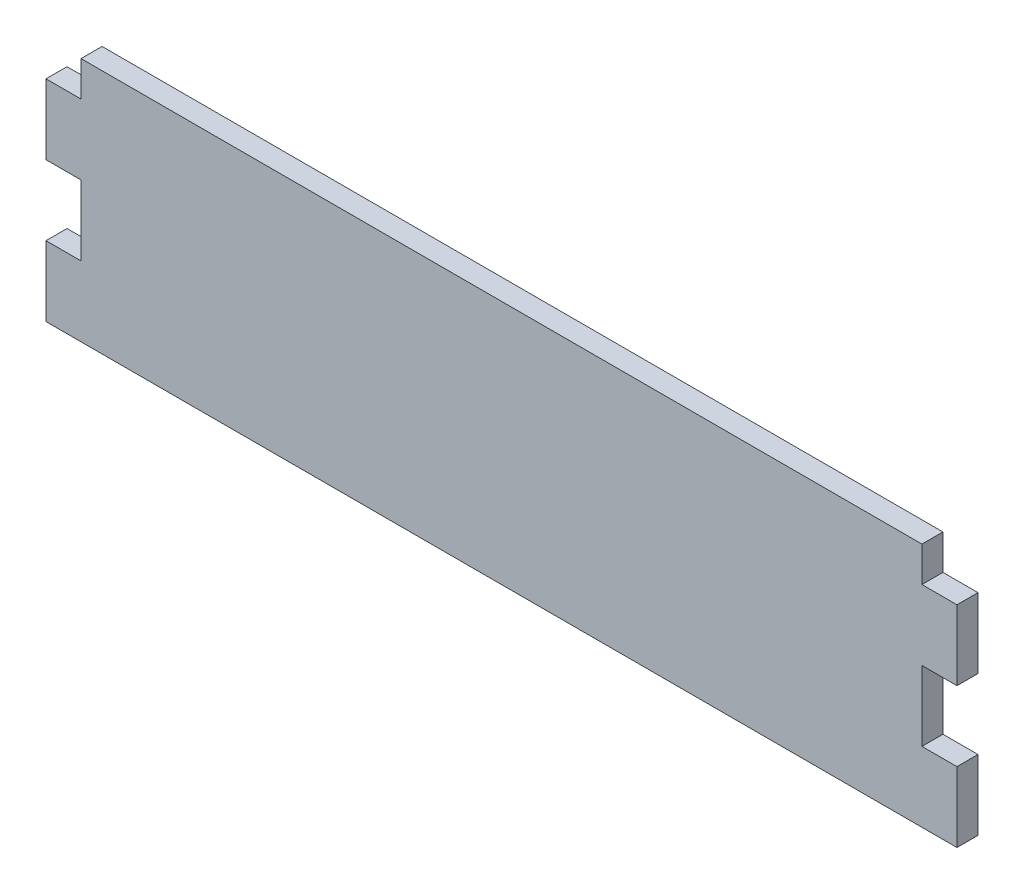
ISO-10303-21;
HEADER;
FILE_DESCRIPTION(('STEP AP214'),'2;1');
FILE_NAME('part.step','',(''),(''),'','','');
FILE_SCHEMA(('AUTOMOTIVE_DESIGN { 1 0 10303 214 1 1 1 1 }'));
ENDSEC;
DATA;
#1=APPLICATION_CONTEXT('core data for automotive mechanical design processes');
#2=APPLICATION_PROTOCOL_DEFINITION('international standard','automotive_design',2000,#1);
#3=PRODUCT_CONTEXT('',#1,'mechanical');
#4=PRODUCT('Part','Part','',(#3));
#5=PRODUCT_RELATED_PRODUCT_CATEGORY('part','',(#4));
#6=PRODUCT_DEFINITION_FORMATION('','',#4);
#7=PRODUCT_DEFINITION_CONTEXT('part definition',#1,'design');
#8=PRODUCT_DEFINITION('design','',#6,#7);
#9=PRODUCT_DEFINITION_SHAPE('','',#8);
#10=(LENGTH_UNIT() NAMED_UNIT(*) SI_UNIT(.MILLI.,.METRE.));
#11=(NAMED_UNIT(*) PLANE_ANGLE_UNIT() SI_UNIT($,.RADIAN.));
#12=(NAMED_UNIT(*) SI_UNIT($,.STERADIAN.) SOLID_ANGLE_UNIT());
#13=UNCERTAINTY_MEASURE_WITH_UNIT(LENGTH_MEASURE(1.E-05),#10,'distance_accuracy_value','');
#14=(GEOMETRIC_REPRESENTATION_CONTEXT(3) GLOBAL_UNCERTAINTY_ASSIGNED_CONTEXT((#13)) GLOBAL_UNIT_ASSIGNED_CONTEXT((#10,
#11,#12)) REPRESENTATION_CONTEXT('',''));
#15=CARTESIAN_POINT('',(0.,0.,0.));
#16=DIRECTION('',(0.,0.,1.));
#17=DIRECTION('',(1.,0.,0.));
#18=AXIS2_PLACEMENT_3D('',#15,#16,#17);
#19=CARTESIAN_POINT('',(119.98,0.,3.));
#20=DIRECTION('',(-1.,0.,0.));
#21=DIRECTION('',(0.,0.,1.));
#22=AXIS2_PLACEMENT_3D('',#19,#20,#21);
#23=PLANE('',#22);
#24=DIRECTION('',(0.,0.,-1.));
#25=VECTOR('',#24,1.);
#26=CARTESIAN_POINT('',(119.98,-15.,3.));
#27=LINE('',#26,#25);
#28=CARTESIAN_POINT('',(119.98,-15.,3.));
#29=VERTEX_POINT('',#28);
#30=CARTESIAN_POINT('',(119.98,-15.,0.));
#31=VERTEX_POINT('',#30);
#32=EDGE_CURVE('E56',#29,#31,#27,.T.);
#33=ORIENTED_EDGE('',*,*,#32,.F.);
#34=DIRECTION('',(0.,1.,0.));
#35=VECTOR('',#34,1.);
#36=CARTESIAN_POINT('',(119.98,0.,3.));
#37=LINE('',#36,#35);
#38=CARTESIAN_POINT('',(119.98,-25.,3.));
#39=VERTEX_POINT('',#38);
#40=EDGE_CURVE('E171',#39,#29,#37,.T.);
#41=ORIENTED_EDGE('',*,*,#40,.F.);
#42=DIRECTION('',(0.,0.,1.));
#43=VECTOR('',#42,1.);
#44=CARTESIAN_POINT('',(119.98,-25.,3.));
#45=LINE('',#44,#43);
#46=CARTESIAN_POINT('',(119.98,-25.,0.));
#47=VERTEX_POINT('',#46);
#48=EDGE_CURVE('E172',#47,#39,#45,.T.);
#49=ORIENTED_EDGE('',*,*,#48,.F.);
#50=DIRECTION('',(0.,1.,0.));
#51=VECTOR('',#50,1.);
#52=CARTESIAN_POINT('',(119.98,0.,0.));
#53=LINE('',#52,#51);
#54=EDGE_CURVE('E255',#47,#31,#53,.T.);
#55=ORIENTED_EDGE('',*,*,#54,.T.);
#56=EDGE_LOOP('',(#33,#41,#49,#55));
#57=FACE_BOUND('',#56,.T.);
#58=ADVANCED_FACE('F33',(#57),#23,.F.);
#59=DIRECTION('',(0.,0.,1.));
#60=VECTOR('',#59,1.);
#61=CARTESIAN_POINT('',(119.98,-5.,3.));
#62=LINE('',#61,#60);
#63=CARTESIAN_POINT('',(119.98,-5.,0.));
#64=VERTEX_POINT('',#63);
#65=CARTESIAN_POINT('',(119.98,-5.,3.));
#66=VERTEX_POINT('',#65);
#67=EDGE_CURVE('E166',#64,#66,#62,.T.);
#68=ORIENTED_EDGE('',*,*,#67,.F.);
#69=CARTESIAN_POINT('',(119.98,0.,0.));
#70=VERTEX_POINT('',#69);
#71=EDGE_CURVE('E254',#64,#70,#53,.T.);
#72=ORIENTED_EDGE('',*,*,#71,.T.);
#73=DIRECTION('',(0.,0.,-1.));
#74=VECTOR('',#73,1.);
#75=CARTESIAN_POINT('',(119.98,0.,3.));
#76=LINE('',#75,#74);
#77=CARTESIAN_POINT('',(119.98,0.,3.));
#78=VERTEX_POINT('',#77);
#79=EDGE_CURVE('E11',#78,#70,#76,.T.);
#80=ORIENTED_EDGE('',*,*,#79,.F.);
#81=EDGE_CURVE('E48',#66,#78,#37,.T.);
#82=ORIENTED_EDGE('',*,*,#81,.F.);
#83=EDGE_LOOP('',(#68,#72,#80,#82));
#84=FACE_BOUND('',#83,.T.);
#85=ADVANCED_FACE('F278',(#84),#23,.F.);
#86=CARTESIAN_POINT('',(0.,0.,3.));
#87=DIRECTION('',(1.,0.,0.));
#88=DIRECTION('',(0.,1.,0.));
#89=AXIS2_PLACEMENT_3D('',#86,#87,#88);
#90=PLANE('',#89);
#91=DIRECTION('',(0.,0.,1.));
#92=VECTOR('',#91,1.);
#93=CARTESIAN_POINT('',(0.,-15.,0.));
#94=LINE('',#93,#92);
#95=CARTESIAN_POINT('',(0.,-15.,0.));
#96=VERTEX_POINT('',#95);
#97=CARTESIAN_POINT('',(0.,-15.,3.));
#98=VERTEX_POINT('',#97);
#99=EDGE_CURVE('E195',#96,#98,#94,.T.);
#100=ORIENTED_EDGE('',*,*,#99,.F.);
#101=DIRECTION('',(0.,-1.,0.));
#102=VECTOR('',#101,1.);
#103=CARTESIAN_POINT('',(0.,0.,0.));
#104=LINE('',#103,#102);
#105=CARTESIAN_POINT('',(0.,-25.,0.));
#106=VERTEX_POINT('',#105);
#107=EDGE_CURVE('E241',#96,#106,#104,.T.);
#108=ORIENTED_EDGE('',*,*,#107,.T.);
#109=DIRECTION('',(0.,0.,-1.));
#110=VECTOR('',#109,1.);
#111=CARTESIAN_POINT('',(0.,-25.,0.));
#112=LINE('',#111,#110);
#113=CARTESIAN_POINT('',(0.,-25.,3.));
#114=VERTEX_POINT('',#113);
#115=EDGE_CURVE('E222',#114,#106,#112,.T.);
#116=ORIENTED_EDGE('',*,*,#115,.F.);
#117=DIRECTION('',(0.,-1.,0.));
#118=VECTOR('',#117,1.);
#119=CARTESIAN_POINT('',(0.,0.,3.));
#120=LINE('',#119,#118);
#121=EDGE_CURVE('E245',#98,#114,#120,.T.);
#122=ORIENTED_EDGE('',*,*,#121,.F.);
#123=EDGE_LOOP('',(#100,#108,#116,#122));
#124=FACE_BOUND('',#123,.T.);
#125=ADVANCED_FACE('F35',(#124),#90,.F.);
#126=DIRECTION('',(0.,0.,-1.));
#127=VECTOR('',#126,1.);
#128=CARTESIAN_POINT('',(0.,-5.,0.));
#129=LINE('',#128,#127);
#130=CARTESIAN_POINT('',(0.,-5.,3.));
#131=VERTEX_POINT('',#130);
#132=CARTESIAN_POINT('',(0.,-5.,0.));
#133=VERTEX_POINT('',#132);
#134=EDGE_CURVE('E200',#131,#133,#129,.T.);
#135=ORIENTED_EDGE('',*,*,#134,.F.);
#136=CARTESIAN_POINT('',(0.,0.,3.));
#137=VERTEX_POINT('',#136);
#138=EDGE_CURVE('E242',#137,#131,#120,.T.);
#139=ORIENTED_EDGE('',*,*,#138,.F.);
#140=DIRECTION('',(0.,0.,-1.));
#141=VECTOR('',#140,1.);
#142=CARTESIAN_POINT('',(0.,0.,3.));
#143=LINE('',#142,#141);
#144=CARTESIAN_POINT('',(0.,0.,0.));
#145=VERTEX_POINT('',#144);
#146=EDGE_CURVE('E41',#137,#145,#143,.T.);
#147=ORIENTED_EDGE('',*,*,#146,.T.);
#148=EDGE_CURVE('E250',#145,#133,#104,.T.);
#149=ORIENTED_EDGE('',*,*,#148,.T.);
#150=EDGE_LOOP('',(#135,#139,#147,#149));
#151=FACE_BOUND('',#150,.T.);
#152=ADVANCED_FACE('F263',(#151),#90,.F.);
#153=CARTESIAN_POINT('',(0.,-35.,3.));
#154=DIRECTION('',(0.,1.,0.));
#155=DIRECTION('',(0.,0.,1.));
#156=AXIS2_PLACEMENT_3D('',#153,#154,#155);
#157=PLANE('',#156);
#158=DIRECTION('',(1.,0.,0.));
#159=VECTOR('',#158,1.);
#160=CARTESIAN_POINT('',(0.,-35.,0.));
#161=LINE('',#160,#159);
#162=CARTESIAN_POINT('',(-5.,-35.,0.));
#163=VERTEX_POINT('',#162);
#164=CARTESIAN_POINT('',(124.98,-35.,0.));
#165=VERTEX_POINT('',#164);
#166=EDGE_CURVE('E252',#163,#165,#161,.T.);
#167=ORIENTED_EDGE('',*,*,#166,.T.);
#168=DIRECTION('',(0.,0.,-1.));
#169=VECTOR('',#168,1.);
#170=CARTESIAN_POINT('',(124.98,-35.,3.));
#171=LINE('',#170,#169);
#172=CARTESIAN_POINT('',(124.98,-35.,3.));
#173=VERTEX_POINT('',#172);
#174=EDGE_CURVE('E183',#173,#165,#171,.T.);
#175=ORIENTED_EDGE('',*,*,#174,.F.);
#176=DIRECTION('',(1.,0.,0.));
#177=VECTOR('',#176,1.);
#178=CARTESIAN_POINT('',(0.,-35.,3.));
#179=LINE('',#178,#177);
#180=CARTESIAN_POINT('',(-5.,-35.,3.));
#181=VERTEX_POINT('',#180);
#182=EDGE_CURVE('E244',#181,#173,#179,.T.);
#183=ORIENTED_EDGE('',*,*,#182,.F.);
#184=DIRECTION('',(0.,0.,1.));
#185=VECTOR('',#184,1.);
#186=CARTESIAN_POINT('',(-5.,-35.,0.));
#187=LINE('',#186,#185);
#188=EDGE_CURVE('E226',#163,#181,#187,.T.);
#189=ORIENTED_EDGE('',*,*,#188,.F.);
#190=EDGE_LOOP('',(#167,#175,#183,#189));
#191=FACE_BOUND('',#190,.T.);
#192=ADVANCED_FACE('F303',(#191),#157,.F.);
#193=CARTESIAN_POINT('',(0.,0.,3.));
#194=DIRECTION('',(0.,-1.,0.));
#195=DIRECTION('',(0.,0.,-1.));
#196=AXIS2_PLACEMENT_3D('',#193,#194,#195);
#197=PLANE('',#196);
#198=DIRECTION('',(-1.,0.,0.));
#199=VECTOR('',#198,1.);
#200=CARTESIAN_POINT('',(0.,0.,0.));
#201=LINE('',#200,#199);
#202=EDGE_CURVE('E257',#70,#145,#201,.T.);
#203=ORIENTED_EDGE('',*,*,#202,.T.);
#204=ORIENTED_EDGE('',*,*,#146,.F.);
#205=DIRECTION('',(-1.,0.,0.));
#206=VECTOR('',#205,1.);
#207=CARTESIAN_POINT('',(0.,0.,3.));
#208=LINE('',#207,#206);
#209=EDGE_CURVE('E248',#78,#137,#208,.T.);
#210=ORIENTED_EDGE('',*,*,#209,.F.);
#211=ORIENTED_EDGE('',*,*,#79,.T.);
#212=EDGE_LOOP('',(#203,#204,#210,#211));
#213=FACE_BOUND('',#212,.T.);
#214=ADVANCED_FACE('F277',(#213),#197,.F.);
#215=CARTESIAN_POINT('',(0.,0.,3.));
#216=DIRECTION('',(0.,0.,1.));
#217=DIRECTION('',(1.,0.,0.));
#218=AXIS2_PLACEMENT_3D('',#215,#216,#217);
#219=PLANE('',#218);
#220=ORIENTED_EDGE('',*,*,#138,.T.);
#221=DIRECTION('',(1.,0.,0.));
#222=VECTOR('',#221,1.);
#223=CARTESIAN_POINT('',(-5.,-5.,3.));
#224=LINE('',#223,#222);
#225=CARTESIAN_POINT('',(-5.,-5.,3.));
#226=VERTEX_POINT('',#225);
#227=EDGE_CURVE('E213',#226,#131,#224,.T.);
#228=ORIENTED_EDGE('',*,*,#227,.F.);
#229=DIRECTION('',(0.,1.,0.));
#230=VECTOR('',#229,1.);
#231=CARTESIAN_POINT('',(-5.,-15.,3.));
#232=LINE('',#231,#230);
#233=CARTESIAN_POINT('',(-5.,-15.,3.));
#234=VERTEX_POINT('',#233);
#235=EDGE_CURVE('E202',#234,#226,#232,.T.);
#236=ORIENTED_EDGE('',*,*,#235,.F.);
#237=DIRECTION('',(1.,0.,0.));
#238=VECTOR('',#237,1.);
#239=CARTESIAN_POINT('',(-5.,-15.,3.));
#240=LINE('',#239,#238);
#241=EDGE_CURVE('E216',#234,#98,#240,.T.);
#242=ORIENTED_EDGE('',*,*,#241,.T.);
#243=ORIENTED_EDGE('',*,*,#121,.T.);
#244=DIRECTION('',(1.,0.,0.));
#245=VECTOR('',#244,1.);
#246=CARTESIAN_POINT('',(-5.,-25.,3.));
#247=LINE('',#246,#245);
#248=CARTESIAN_POINT('',(-5.,-25.,3.));
#249=VERTEX_POINT('',#248);
#250=EDGE_CURVE('E238',#249,#114,#247,.T.);
#251=ORIENTED_EDGE('',*,*,#250,.F.);
#252=DIRECTION('',(0.,1.,0.));
#253=VECTOR('',#252,1.);
#254=CARTESIAN_POINT('',(-5.,-35.,3.));
#255=LINE('',#254,#253);
#256=EDGE_CURVE('E229',#181,#249,#255,.T.);
#257=ORIENTED_EDGE('',*,*,#256,.F.);
#258=ORIENTED_EDGE('',*,*,#182,.T.);
#259=DIRECTION('',(0.,-1.,0.));
#260=VECTOR('',#259,1.);
#261=CARTESIAN_POINT('',(124.98,-35.,3.));
#262=LINE('',#261,#260);
#263=CARTESIAN_POINT('',(124.98,-25.,3.));
#264=VERTEX_POINT('',#263);
#265=EDGE_CURVE('E175',#264,#173,#262,.T.);
#266=ORIENTED_EDGE('',*,*,#265,.F.);
#267=DIRECTION('',(-1.,0.,0.));
#268=VECTOR('',#267,1.);
#269=CARTESIAN_POINT('',(124.98,-25.,3.));
#270=LINE('',#269,#268);
#271=EDGE_CURVE('E189',#264,#39,#270,.T.);
#272=ORIENTED_EDGE('',*,*,#271,.T.);
#273=ORIENTED_EDGE('',*,*,#40,.T.);
#274=DIRECTION('',(-1.,0.,0.));
#275=VECTOR('',#274,1.);
#276=CARTESIAN_POINT('',(124.98,-15.,3.));
#277=LINE('',#276,#275);
#278=CARTESIAN_POINT('',(124.98,-15.,3.));
#279=VERTEX_POINT('',#278);
#280=EDGE_CURVE('E151',#279,#29,#277,.T.);
#281=ORIENTED_EDGE('',*,*,#280,.F.);
#282=DIRECTION('',(0.,-1.,0.));
#283=VECTOR('',#282,1.);
#284=CARTESIAN_POINT('',(124.98,-15.,3.));
#285=LINE('',#284,#283);
#286=CARTESIAN_POINT('',(124.98,-5.,3.));
#287=VERTEX_POINT('',#286);
#288=EDGE_CURVE('E157',#287,#279,#285,.T.);
#289=ORIENTED_EDGE('',*,*,#288,.F.);
#290=DIRECTION('',(-1.,0.,0.));
#291=VECTOR('',#290,1.);
#292=CARTESIAN_POINT('',(124.98,-5.,3.));
#293=LINE('',#292,#291);
#294=EDGE_CURVE('E282',#287,#66,#293,.T.);
#295=ORIENTED_EDGE('',*,*,#294,.T.);
#296=ORIENTED_EDGE('',*,*,#81,.T.);
#297=ORIENTED_EDGE('',*,*,#209,.T.);
#298=EDGE_LOOP('',(#220,#228,#236,#242,#243,#251,#257,#258,#266,#272,#273,#281,#289,#295,#296,#297));
#299=FACE_BOUND('',#298,.T.);
#300=ADVANCED_FACE('F169',(#299),#219,.T.);
#301=CARTESIAN_POINT('',(0.,0.,0.));
#302=DIRECTION('',(0.,0.,1.));
#303=DIRECTION('',(1.,0.,0.));
#304=AXIS2_PLACEMENT_3D('',#301,#302,#303);
#305=PLANE('',#304);
#306=ORIENTED_EDGE('',*,*,#148,.F.);
#307=ORIENTED_EDGE('',*,*,#202,.F.);
#308=ORIENTED_EDGE('',*,*,#71,.F.);
#309=DIRECTION('',(-1.,0.,0.));
#310=VECTOR('',#309,1.);
#311=CARTESIAN_POINT('',(124.98,-5.,0.));
#312=LINE('',#311,#310);
#313=CARTESIAN_POINT('',(124.98,-5.,0.));
#314=VERTEX_POINT('',#313);
#315=EDGE_CURVE('E177',#314,#64,#312,.T.);
#316=ORIENTED_EDGE('',*,*,#315,.F.);
#317=DIRECTION('',(0.,1.,0.));
#318=VECTOR('',#317,1.);
#319=CARTESIAN_POINT('',(124.98,-15.,0.));
#320=LINE('',#319,#318);
#321=CARTESIAN_POINT('',(124.98,-15.,0.));
#322=VERTEX_POINT('',#321);
#323=EDGE_CURVE('E156',#322,#314,#320,.T.);
#324=ORIENTED_EDGE('',*,*,#323,.F.);
#325=DIRECTION('',(-1.,0.,0.));
#326=VECTOR('',#325,1.);
#327=CARTESIAN_POINT('',(124.98,-15.,0.));
#328=LINE('',#327,#326);
#329=EDGE_CURVE('E153',#322,#31,#328,.T.);
#330=ORIENTED_EDGE('',*,*,#329,.T.);
#331=ORIENTED_EDGE('',*,*,#54,.F.);
#332=DIRECTION('',(-1.,0.,0.));
#333=VECTOR('',#332,1.);
#334=CARTESIAN_POINT('',(124.98,-25.,0.));
#335=LINE('',#334,#333);
#336=CARTESIAN_POINT('',(124.98,-25.,0.));
#337=VERTEX_POINT('',#336);
#338=EDGE_CURVE('E192',#337,#47,#335,.T.);
#339=ORIENTED_EDGE('',*,*,#338,.F.);
#340=DIRECTION('',(0.,1.,0.));
#341=VECTOR('',#340,1.);
#342=CARTESIAN_POINT('',(124.98,-35.,0.));
#343=LINE('',#342,#341);
#344=EDGE_CURVE('E186',#165,#337,#343,.T.);
#345=ORIENTED_EDGE('',*,*,#344,.F.);
#346=ORIENTED_EDGE('',*,*,#166,.F.);
#347=DIRECTION('',(0.,-1.,0.));
#348=VECTOR('',#347,1.);
#349=CARTESIAN_POINT('',(-5.,-35.,0.));
#350=LINE('',#349,#348);
#351=CARTESIAN_POINT('',(-5.,-25.,0.));
#352=VERTEX_POINT('',#351);
#353=EDGE_CURVE('E223',#352,#163,#350,.T.);
#354=ORIENTED_EDGE('',*,*,#353,.F.);
#355=DIRECTION('',(1.,0.,0.));
#356=VECTOR('',#355,1.);
#357=CARTESIAN_POINT('',(-5.,-25.,0.));
#358=LINE('',#357,#356);
#359=EDGE_CURVE('E233',#352,#106,#358,.T.);
#360=ORIENTED_EDGE('',*,*,#359,.T.);
#361=ORIENTED_EDGE('',*,*,#107,.F.);
#362=DIRECTION('',(1.,0.,0.));
#363=VECTOR('',#362,1.);
#364=CARTESIAN_POINT('',(-5.,-15.,0.));
#365=LINE('',#364,#363);
#366=CARTESIAN_POINT('',(-5.,-15.,0.));
#367=VERTEX_POINT('',#366);
#368=EDGE_CURVE('E219',#367,#96,#365,.T.);
#369=ORIENTED_EDGE('',*,*,#368,.F.);
#370=DIRECTION('',(0.,-1.,0.));
#371=VECTOR('',#370,1.);
#372=CARTESIAN_POINT('',(-5.,-15.,0.));
#373=LINE('',#372,#371);
#374=CARTESIAN_POINT('',(-5.,-5.,0.));
#375=VERTEX_POINT('',#374);
#376=EDGE_CURVE('E196',#375,#367,#373,.T.);
#377=ORIENTED_EDGE('',*,*,#376,.F.);
#378=DIRECTION('',(1.,0.,0.));
#379=VECTOR('',#378,1.);
#380=CARTESIAN_POINT('',(-5.,-5.,0.));
#381=LINE('',#380,#379);
#382=EDGE_CURVE('E206',#375,#133,#381,.T.);
#383=ORIENTED_EDGE('',*,*,#382,.T.);
#384=EDGE_LOOP('',(#306,#307,#308,#316,#324,#330,#331,#339,#345,#346,#354,#360,#361,#369,#377,#383));
#385=FACE_BOUND('',#384,.T.);
#386=ADVANCED_FACE('F268',(#385),#305,.F.);
#387=CARTESIAN_POINT('',(-5.,-25.,0.));
#388=DIRECTION('',(0.,-1.,0.));
#389=DIRECTION('',(1.,0.,0.));
#390=AXIS2_PLACEMENT_3D('',#387,#388,#389);
#391=PLANE('',#390);
#392=ORIENTED_EDGE('',*,*,#115,.T.);
#393=ORIENTED_EDGE('',*,*,#359,.F.);
#394=DIRECTION('',(0.,0.,-1.));
#395=VECTOR('',#394,1.);
#396=CARTESIAN_POINT('',(-5.,-25.,0.));
#397=LINE('',#396,#395);
#398=EDGE_CURVE('E231',#249,#352,#397,.T.);
#399=ORIENTED_EDGE('',*,*,#398,.F.);
#400=ORIENTED_EDGE('',*,*,#250,.T.);
#401=EDGE_LOOP('',(#392,#393,#399,#400));
#402=FACE_BOUND('',#401,.T.);
#403=ADVANCED_FACE('F311',(#402),#391,.F.);
#404=CARTESIAN_POINT('',(-5.,0.,0.));
#405=DIRECTION('',(1.,0.,0.));
#406=DIRECTION('',(0.,1.,0.));
#407=AXIS2_PLACEMENT_3D('',#404,#405,#406);
#408=PLANE('',#407);
#409=ORIENTED_EDGE('',*,*,#353,.T.);
#410=ORIENTED_EDGE('',*,*,#188,.T.);
#411=ORIENTED_EDGE('',*,*,#256,.T.);
#412=ORIENTED_EDGE('',*,*,#398,.T.);
#413=EDGE_LOOP('',(#409,#410,#411,#412));
#414=FACE_BOUND('',#413,.T.);
#415=ADVANCED_FACE('F306',(#414),#408,.F.);
#416=CARTESIAN_POINT('',(-5.,-15.,0.));
#417=DIRECTION('',(0.,1.,0.));
#418=DIRECTION('',(-1.,0.,0.));
#419=AXIS2_PLACEMENT_3D('',#416,#417,#418);
#420=PLANE('',#419);
#421=ORIENTED_EDGE('',*,*,#99,.T.);
#422=ORIENTED_EDGE('',*,*,#241,.F.);
#423=DIRECTION('',(0.,0.,1.));
#424=VECTOR('',#423,1.);
#425=CARTESIAN_POINT('',(-5.,-15.,0.));
#426=LINE('',#425,#424);
#427=EDGE_CURVE('E199',#367,#234,#426,.T.);
#428=ORIENTED_EDGE('',*,*,#427,.F.);
#429=ORIENTED_EDGE('',*,*,#368,.T.);
#430=EDGE_LOOP('',(#421,#422,#428,#429));
#431=FACE_BOUND('',#430,.T.);
#432=ADVANCED_FACE('F317',(#431),#420,.F.);
#433=CARTESIAN_POINT('',(-5.,-5.,0.));
#434=DIRECTION('',(0.,-1.,0.));
#435=DIRECTION('',(1.,0.,0.));
#436=AXIS2_PLACEMENT_3D('',#433,#434,#435);
#437=PLANE('',#436);
#438=ORIENTED_EDGE('',*,*,#134,.T.);
#439=ORIENTED_EDGE('',*,*,#382,.F.);
#440=DIRECTION('',(0.,0.,-1.));
#441=VECTOR('',#440,1.);
#442=CARTESIAN_POINT('',(-5.,-5.,0.));
#443=LINE('',#442,#441);
#444=EDGE_CURVE('E204',#226,#375,#443,.T.);
#445=ORIENTED_EDGE('',*,*,#444,.F.);
#446=ORIENTED_EDGE('',*,*,#227,.T.);
#447=EDGE_LOOP('',(#438,#439,#445,#446));
#448=FACE_BOUND('',#447,.T.);
#449=ADVANCED_FACE('F274',(#448),#437,.F.);
#450=CARTESIAN_POINT('',(-5.,20.,0.));
#451=DIRECTION('',(1.,0.,0.));
#452=DIRECTION('',(0.,1.,0.));
#453=AXIS2_PLACEMENT_3D('',#450,#451,#452);
#454=PLANE('',#453);
#455=ORIENTED_EDGE('',*,*,#376,.T.);
#456=ORIENTED_EDGE('',*,*,#427,.T.);
#457=ORIENTED_EDGE('',*,*,#235,.T.);
#458=ORIENTED_EDGE('',*,*,#444,.T.);
#459=EDGE_LOOP('',(#455,#456,#457,#458));
#460=FACE_BOUND('',#459,.T.);
#461=ADVANCED_FACE('F319',(#460),#454,.F.);
#462=CARTESIAN_POINT('',(124.98,-25.,3.));
#463=DIRECTION('',(0.,-1.,0.));
#464=DIRECTION('',(0.,0.,-1.));
#465=AXIS2_PLACEMENT_3D('',#462,#463,#464);
#466=PLANE('',#465);
#467=ORIENTED_EDGE('',*,*,#48,.T.);
#468=ORIENTED_EDGE('',*,*,#271,.F.);
#469=DIRECTION('',(0.,0.,1.));
#470=VECTOR('',#469,1.);
#471=CARTESIAN_POINT('',(124.98,-25.,3.));
#472=LINE('',#471,#470);
#473=EDGE_CURVE('E188',#337,#264,#472,.T.);
#474=ORIENTED_EDGE('',*,*,#473,.F.);
#475=ORIENTED_EDGE('',*,*,#338,.T.);
#476=EDGE_LOOP('',(#467,#468,#474,#475));
#477=FACE_BOUND('',#476,.T.);
#478=ADVANCED_FACE('F294',(#477),#466,.F.);
#479=CARTESIAN_POINT('',(124.98,0.,0.));
#480=DIRECTION('',(-1.,0.,0.));
#481=DIRECTION('',(0.,0.,1.));
#482=AXIS2_PLACEMENT_3D('',#479,#480,#481);
#483=PLANE('',#482);
#484=ORIENTED_EDGE('',*,*,#265,.T.);
#485=ORIENTED_EDGE('',*,*,#174,.T.);
#486=ORIENTED_EDGE('',*,*,#344,.T.);
#487=ORIENTED_EDGE('',*,*,#473,.T.);
#488=EDGE_LOOP('',(#484,#485,#486,#487));
#489=FACE_BOUND('',#488,.T.);
#490=ADVANCED_FACE('F298',(#489),#483,.F.);
#491=CARTESIAN_POINT('',(124.98,-15.,3.));
#492=DIRECTION('',(0.,1.,0.));
#493=DIRECTION('',(0.,0.,1.));
#494=AXIS2_PLACEMENT_3D('',#491,#492,#493);
#495=PLANE('',#494);
#496=ORIENTED_EDGE('',*,*,#32,.T.);
#497=ORIENTED_EDGE('',*,*,#329,.F.);
#498=DIRECTION('',(0.,0.,-1.));
#499=VECTOR('',#498,1.);
#500=CARTESIAN_POINT('',(124.98,-15.,3.));
#501=LINE('',#500,#499);
#502=EDGE_CURVE('E147',#279,#322,#501,.T.);
#503=ORIENTED_EDGE('',*,*,#502,.F.);
#504=ORIENTED_EDGE('',*,*,#280,.T.);
#505=EDGE_LOOP('',(#496,#497,#503,#504));
#506=FACE_BOUND('',#505,.T.);
#507=ADVANCED_FACE('F149',(#506),#495,.F.);
#508=CARTESIAN_POINT('',(124.98,-5.,3.));
#509=DIRECTION('',(0.,-1.,0.));
#510=DIRECTION('',(0.,0.,-1.));
#511=AXIS2_PLACEMENT_3D('',#508,#509,#510);
#512=PLANE('',#511);
#513=ORIENTED_EDGE('',*,*,#67,.T.);
#514=ORIENTED_EDGE('',*,*,#294,.F.);
#515=DIRECTION('',(0.,0.,1.));
#516=VECTOR('',#515,1.);
#517=CARTESIAN_POINT('',(124.98,-5.,3.));
#518=LINE('',#517,#516);
#519=EDGE_CURVE('E162',#314,#287,#518,.T.);
#520=ORIENTED_EDGE('',*,*,#519,.F.);
#521=ORIENTED_EDGE('',*,*,#315,.T.);
#522=EDGE_LOOP('',(#513,#514,#520,#521));
#523=FACE_BOUND('',#522,.T.);
#524=ADVANCED_FACE('F283',(#523),#512,.F.);
#525=CARTESIAN_POINT('',(124.98,20.,0.));
#526=DIRECTION('',(-1.,0.,0.));
#527=DIRECTION('',(0.,0.,1.));
#528=AXIS2_PLACEMENT_3D('',#525,#526,#527);
#529=PLANE('',#528);
#530=ORIENTED_EDGE('',*,*,#288,.T.);
#531=ORIENTED_EDGE('',*,*,#502,.T.);
#532=ORIENTED_EDGE('',*,*,#323,.T.);
#533=ORIENTED_EDGE('',*,*,#519,.T.);
#534=EDGE_LOOP('',(#530,#531,#532,#533));
#535=FACE_BOUND('',#534,.T.);
#536=ADVANCED_FACE('F160',(#535),#529,.F.);
#537=CLOSED_SHELL('',(#58,#85,#125,#152,#192,#214,#300,#386,#403,#415,#432,#449,#461,#478,#490,
#507,#524,#536));
#538=MANIFOLD_SOLID_BREP('B2',#537);
#539=ADVANCED_BREP_SHAPE_REPRESENTATION('',(#18,#538),#14);
#540=SHAPE_DEFINITION_REPRESENTATION(#9,#539);
ENDSEC;
END-ISO-10303-21;
